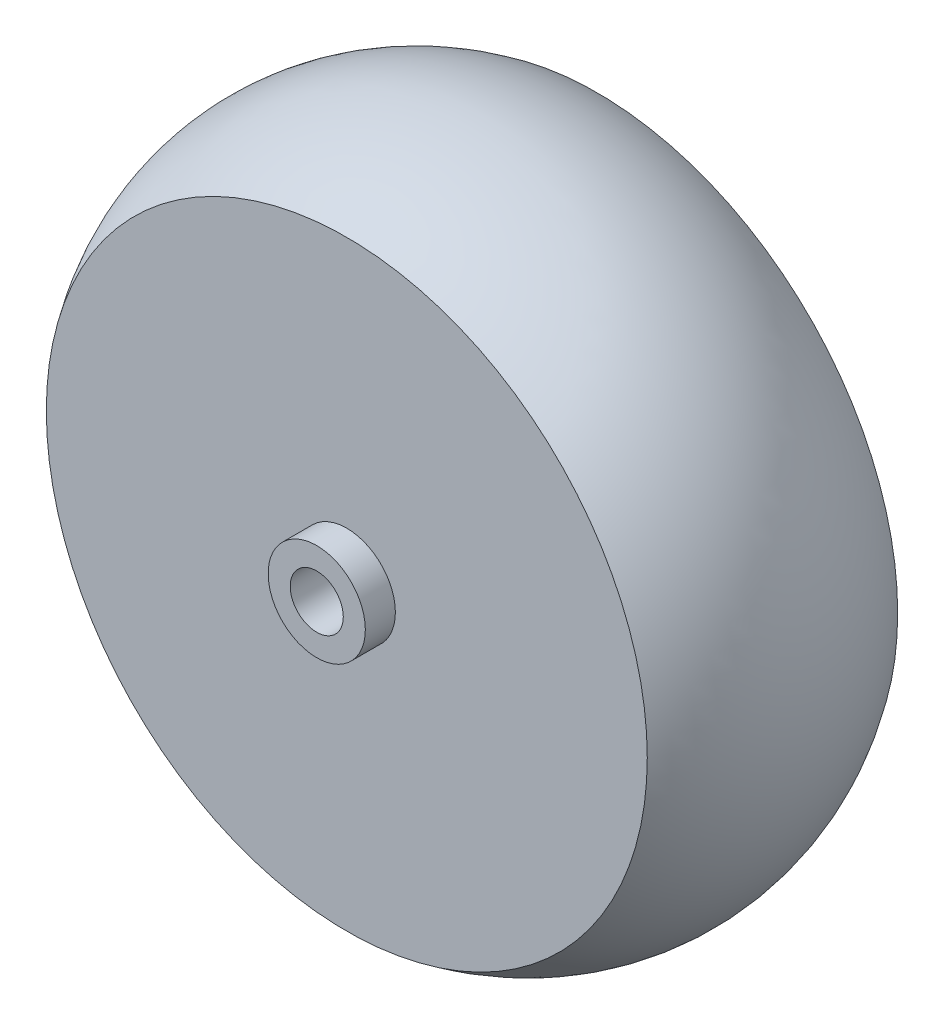
ISO-10303-21;
HEADER;
FILE_DESCRIPTION(('STEP AP214'),'2;1');
FILE_NAME('part.step','',(''),(''),'','','');
FILE_SCHEMA(('AUTOMOTIVE_DESIGN { 1 0 10303 214 1 1 1 1 }'));
ENDSEC;
DATA;
#1=APPLICATION_CONTEXT('core data for automotive mechanical design processes');
#2=APPLICATION_PROTOCOL_DEFINITION('international standard','automotive_design',2000,#1);
#3=PRODUCT_CONTEXT('',#1,'mechanical');
#4=PRODUCT('Part','Part','',(#3));
#5=PRODUCT_RELATED_PRODUCT_CATEGORY('part','',(#4));
#6=PRODUCT_DEFINITION_FORMATION('','',#4);
#7=PRODUCT_DEFINITION_CONTEXT('part definition',#1,'design');
#8=PRODUCT_DEFINITION('design','',#6,#7);
#9=PRODUCT_DEFINITION_SHAPE('','',#8);
#10=(LENGTH_UNIT() NAMED_UNIT(*) SI_UNIT(.MILLI.,.METRE.));
#11=(NAMED_UNIT(*) PLANE_ANGLE_UNIT() SI_UNIT($,.RADIAN.));
#12=(NAMED_UNIT(*) SI_UNIT($,.STERADIAN.) SOLID_ANGLE_UNIT());
#13=UNCERTAINTY_MEASURE_WITH_UNIT(LENGTH_MEASURE(1.E-05),#10,'distance_accuracy_value','');
#14=(GEOMETRIC_REPRESENTATION_CONTEXT(3) GLOBAL_UNCERTAINTY_ASSIGNED_CONTEXT((#13)) GLOBAL_UNIT_ASSIGNED_CONTEXT((#10,
#11,#12)) REPRESENTATION_CONTEXT('',''));
#15=CARTESIAN_POINT('',(0.,0.,0.));
#16=DIRECTION('',(0.,0.,1.));
#17=DIRECTION('',(1.,0.,0.));
#18=AXIS2_PLACEMENT_3D('',#15,#16,#17);
#19=CARTESIAN_POINT('',(1.98997487421324,-1.75,-10.));
#20=DIRECTION('',(0.,-1.,0.));
#21=DIRECTION('',(0.,0.,-1.));
#22=AXIS2_PLACEMENT_3D('',#19,#20,#21);
#23=PLANE('',#22);
#24=DIRECTION('',(-1.,0.,0.));
#25=VECTOR('',#24,1.);
#26=CARTESIAN_POINT('',(1.98997487421324,-1.75,-5.));
#27=LINE('',#26,#25);
#28=CARTESIAN_POINT('',(1.98997487421324,-1.75,-5.));
#29=VERTEX_POINT('',#28);
#30=CARTESIAN_POINT('',(-1.98997487421324,-1.75,-5.));
#31=VERTEX_POINT('',#30);
#32=EDGE_CURVE('E86',#29,#31,#27,.T.);
#33=ORIENTED_EDGE('',*,*,#32,.F.);
#34=DIRECTION('',(0.,0.,1.));
#35=VECTOR('',#34,1.);
#36=CARTESIAN_POINT('',(1.98997487421324,-1.75,-10.));
#37=LINE('',#36,#35);
#38=CARTESIAN_POINT('',(1.98997487421324,-1.75,-10.));
#39=VERTEX_POINT('',#38);
#40=EDGE_CURVE('E105',#39,#29,#37,.T.);
#41=ORIENTED_EDGE('',*,*,#40,.F.);
#42=DIRECTION('',(1.,0.,0.));
#43=VECTOR('',#42,1.);
#44=CARTESIAN_POINT('',(1.98997487421324,-1.75,-10.));
#45=LINE('',#44,#43);
#46=CARTESIAN_POINT('',(-1.98997487421324,-1.75,-10.));
#47=VERTEX_POINT('',#46);
#48=EDGE_CURVE('E92',#47,#39,#45,.T.);
#49=ORIENTED_EDGE('',*,*,#48,.F.);
#50=DIRECTION('',(0.,0.,1.));
#51=VECTOR('',#50,1.);
#52=CARTESIAN_POINT('',(-1.98997487421324,-1.75,-10.));
#53=LINE('',#52,#51);
#54=EDGE_CURVE('E94',#47,#31,#53,.T.);
#55=ORIENTED_EDGE('',*,*,#54,.T.);
#56=EDGE_LOOP('',(#33,#41,#49,#55));
#57=FACE_BOUND('',#56,.T.);
#58=ADVANCED_FACE('F38',(#57),#23,.F.);
#59=CARTESIAN_POINT('',(1.98997487421324,1.75,-10.));
#60=DIRECTION('',(0.,1.,0.));
#61=DIRECTION('',(0.,0.,1.));
#62=AXIS2_PLACEMENT_3D('',#59,#60,#61);
#63=PLANE('',#62);
#64=DIRECTION('',(1.,0.,0.));
#65=VECTOR('',#64,1.);
#66=CARTESIAN_POINT('',(1.98997487421324,1.75,-5.));
#67=LINE('',#66,#65);
#68=CARTESIAN_POINT('',(-1.98997487421324,1.75,-5.));
#69=VERTEX_POINT('',#68);
#70=CARTESIAN_POINT('',(1.98997487421324,1.75,-5.));
#71=VERTEX_POINT('',#70);
#72=EDGE_CURVE('E11',#69,#71,#67,.T.);
#73=ORIENTED_EDGE('',*,*,#72,.F.);
#74=DIRECTION('',(0.,0.,1.));
#75=VECTOR('',#74,1.);
#76=CARTESIAN_POINT('',(-1.98997487421324,1.75,-10.));
#77=LINE('',#76,#75);
#78=CARTESIAN_POINT('',(-1.98997487421324,1.75,-10.));
#79=VERTEX_POINT('',#78);
#80=EDGE_CURVE('E85',#79,#69,#77,.T.);
#81=ORIENTED_EDGE('',*,*,#80,.F.);
#82=DIRECTION('',(-1.,0.,0.));
#83=VECTOR('',#82,1.);
#84=CARTESIAN_POINT('',(1.98997487421324,1.75,-10.));
#85=LINE('',#84,#83);
#86=CARTESIAN_POINT('',(1.98997487421324,1.75,-10.));
#87=VERTEX_POINT('',#86);
#88=EDGE_CURVE('E90',#87,#79,#85,.T.);
#89=ORIENTED_EDGE('',*,*,#88,.F.);
#90=DIRECTION('',(0.,0.,1.));
#91=VECTOR('',#90,1.);
#92=CARTESIAN_POINT('',(1.98997487421324,1.75,-10.));
#93=LINE('',#92,#91);
#94=EDGE_CURVE('E82',#87,#71,#93,.T.);
#95=ORIENTED_EDGE('',*,*,#94,.T.);
#96=EDGE_LOOP('',(#73,#81,#89,#95));
#97=FACE_BOUND('',#96,.T.);
#98=ADVANCED_FACE('F88',(#97),#63,.F.);
#99=CARTESIAN_POINT('',(0.,0.,0.));
#100=DIRECTION('',(0.,0.,1.));
#101=DIRECTION('',(1.,0.,0.));
#102=AXIS2_PLACEMENT_3D('',#99,#100,#101);
#103=PLANE('',#102);
#104=CARTESIAN_POINT('',(0.,0.,0.));
#105=DIRECTION('',(0.,0.,1.));
#106=DIRECTION('',(1.,0.,0.));
#107=AXIS2_PLACEMENT_3D('',#104,#105,#106);
#108=CIRCLE('',#107,2.65);
#109=CARTESIAN_POINT('',(2.65,0.,0.));
#110=VERTEX_POINT('',#109);
#111=EDGE_CURVE('E226',#110,#110,#108,.T.);
#112=ORIENTED_EDGE('',*,*,#111,.F.);
#113=EDGE_LOOP('',(#112));
#114=FACE_BOUND('',#113,.T.);
#115=CARTESIAN_POINT('',(0.,0.,0.));
#116=DIRECTION('',(0.,0.,1.));
#117=DIRECTION('',(1.,0.,0.));
#118=AXIS2_PLACEMENT_3D('',#115,#116,#117);
#119=CIRCLE('',#118,4.85);
#120=CARTESIAN_POINT('',(4.85,0.,0.));
#121=VERTEX_POINT('',#120);
#122=EDGE_CURVE('E46',#121,#121,#119,.T.);
#123=ORIENTED_EDGE('',*,*,#122,.T.);
#124=EDGE_LOOP('',(#123));
#125=FACE_BOUND('',#124,.T.);
#126=ADVANCED_FACE('F40',(#114,#125),#103,.T.);
#127=CARTESIAN_POINT('',(0.,0.,0.));
#128=DIRECTION('',(0.,0.,1.));
#129=DIRECTION('',(1.,0.,0.));
#130=AXIS2_PLACEMENT_3D('',#127,#128,#129);
#131=CYLINDRICAL_SURFACE('',#130,4.85);
#132=CARTESIAN_POINT('',(0.,0.,-3.));
#133=DIRECTION('',(0.,0.,1.));
#134=DIRECTION('',(1.,0.,0.));
#135=AXIS2_PLACEMENT_3D('',#132,#133,#134);
#136=CIRCLE('',#135,4.85);
#137=CARTESIAN_POINT('',(4.85,0.,-3.));
#138=VERTEX_POINT('',#137);
#139=EDGE_CURVE('E108',#138,#138,#136,.T.);
#140=ORIENTED_EDGE('',*,*,#139,.T.);
#141=EDGE_LOOP('',(#140));
#142=FACE_BOUND('',#141,.T.);
#143=ORIENTED_EDGE('',*,*,#122,.F.);
#144=EDGE_LOOP('',(#143));
#145=FACE_BOUND('',#144,.T.);
#146=ADVANCED_FACE('F114',(#142,#145),#131,.T.);
#147=CARTESIAN_POINT('',(4.85,0.,-3.));
#148=DIRECTION('',(0.,0.,1.));
#149=DIRECTION('',(1.,0.,0.));
#150=AXIS2_PLACEMENT_3D('',#147,#148,#149);
#151=PLANE('',#150);
#152=CARTESIAN_POINT('',(0.,0.,-3.00000000000001));
#153=DIRECTION('',(0.,0.,1.));
#154=DIRECTION('',(1.,0.,0.));
#155=AXIS2_PLACEMENT_3D('',#152,#153,#154);
#156=CIRCLE('',#155,30.);
#157=CARTESIAN_POINT('',(30.,0.,-3.00000000000001));
#158=VERTEX_POINT('',#157);
#159=EDGE_CURVE('E104',#158,#158,#156,.T.);
#160=ORIENTED_EDGE('',*,*,#159,.T.);
#161=EDGE_LOOP('',(#160));
#162=FACE_BOUND('',#161,.T.);
#163=ORIENTED_EDGE('',*,*,#139,.F.);
#164=EDGE_LOOP('',(#163));
#165=FACE_BOUND('',#164,.T.);
#166=ADVANCED_FACE('F116',(#162,#165),#151,.T.);
#167=CARTESIAN_POINT('',(0.,0.,-15.5));
#168=DIRECTION('',(0.,0.,1.));
#169=DIRECTION('',(1.,0.,0.));
#170=AXIS2_PLACEMENT_3D('',#167,#168,#169);
#171=DEGENERATE_TOROIDAL_SURFACE('',#170,12.46875,21.53125,.T.);
#172=CARTESIAN_POINT('',(0.,0.,-28.));
#173=DIRECTION('',(0.,0.,1.));
#174=DIRECTION('',(1.,0.,0.));
#175=AXIS2_PLACEMENT_3D('',#172,#173,#174);
#176=CIRCLE('',#175,30.);
#177=CARTESIAN_POINT('',(30.,0.,-28.));
#178=VERTEX_POINT('',#177);
#179=EDGE_CURVE('E101',#178,#178,#176,.T.);
#180=ORIENTED_EDGE('',*,*,#179,.T.);
#181=EDGE_LOOP('',(#180));
#182=FACE_BOUND('',#181,.T.);
#183=ORIENTED_EDGE('',*,*,#159,.F.);
#184=EDGE_LOOP('',(#183));
#185=FACE_BOUND('',#184,.T.);
#186=ADVANCED_FACE('F122',(#182,#185),#171,.T.);
#187=CARTESIAN_POINT('',(0.,0.,-28.));
#188=DIRECTION('',(0.,0.,-1.));
#189=DIRECTION('',(-1.,0.,0.));
#190=AXIS2_PLACEMENT_3D('',#187,#188,#189);
#191=PLANE('',#190);
#192=ORIENTED_EDGE('',*,*,#179,.F.);
#193=EDGE_LOOP('',(#192));
#194=FACE_BOUND('',#193,.T.);
#195=ADVANCED_FACE('F139',(#194),#191,.T.);
#196=CARTESIAN_POINT('',(0.,0.,-10.));
#197=DIRECTION('',(0.,0.,1.));
#198=DIRECTION('',(1.,0.,0.));
#199=AXIS2_PLACEMENT_3D('',#196,#197,#198);
#200=CYLINDRICAL_SURFACE('',#199,2.65);
#201=ORIENTED_EDGE('',*,*,#111,.T.);
#202=EDGE_LOOP('',(#201));
#203=FACE_BOUND('',#202,.T.);
#204=CARTESIAN_POINT('',(0.,0.,-5.));
#205=DIRECTION('',(0.,0.,1.));
#206=DIRECTION('',(1.,0.,0.));
#207=AXIS2_PLACEMENT_3D('',#204,#205,#206);
#208=CIRCLE('',#207,2.65);
#209=EDGE_CURVE('E58',#71,#69,#208,.T.);
#210=ORIENTED_EDGE('',*,*,#209,.F.);
#211=ORIENTED_EDGE('',*,*,#94,.F.);
#212=CARTESIAN_POINT('',(0.,0.,-10.));
#213=DIRECTION('',(0.,0.,1.));
#214=DIRECTION('',(1.,0.,0.));
#215=AXIS2_PLACEMENT_3D('',#212,#213,#214);
#216=CIRCLE('',#215,2.65);
#217=EDGE_CURVE('E233',#39,#87,#216,.T.);
#218=ORIENTED_EDGE('',*,*,#217,.F.);
#219=ORIENTED_EDGE('',*,*,#40,.T.);
#220=EDGE_CURVE('E52',#31,#29,#208,.T.);
#221=ORIENTED_EDGE('',*,*,#220,.F.);
#222=ORIENTED_EDGE('',*,*,#54,.F.);
#223=CARTESIAN_POINT('',(0.,0.,-10.));
#224=DIRECTION('',(0.,0.,1.));
#225=DIRECTION('',(1.,0.,0.));
#226=AXIS2_PLACEMENT_3D('',#223,#224,#225);
#227=CIRCLE('',#226,2.65);
#228=EDGE_CURVE('E97',#79,#47,#227,.T.);
#229=ORIENTED_EDGE('',*,*,#228,.F.);
#230=ORIENTED_EDGE('',*,*,#80,.T.);
#231=EDGE_LOOP('',(#210,#211,#218,#219,#221,#222,#229,#230));
#232=FACE_BOUND('',#231,.T.);
#233=ADVANCED_FACE('F80',(#203,#232),#200,.F.);
#234=CARTESIAN_POINT('',(0.,0.,-10.));
#235=DIRECTION('',(0.,0.,1.));
#236=DIRECTION('',(1.,0.,0.));
#237=AXIS2_PLACEMENT_3D('',#234,#235,#236);
#238=PLANE('',#237);
#239=ORIENTED_EDGE('',*,*,#217,.T.);
#240=ORIENTED_EDGE('',*,*,#88,.T.);
#241=ORIENTED_EDGE('',*,*,#228,.T.);
#242=ORIENTED_EDGE('',*,*,#48,.T.);
#243=EDGE_LOOP('',(#239,#240,#241,#242));
#244=FACE_BOUND('',#243,.T.);
#245=ADVANCED_FACE('F134',(#244),#238,.T.);
#246=CARTESIAN_POINT('',(0.,0.,-5.));
#247=DIRECTION('',(0.,0.,1.));
#248=DIRECTION('',(1.,0.,0.));
#249=AXIS2_PLACEMENT_3D('',#246,#247,#248);
#250=PLANE('',#249);
#251=ORIENTED_EDGE('',*,*,#72,.T.);
#252=ORIENTED_EDGE('',*,*,#209,.T.);
#253=EDGE_LOOP('',(#251,#252));
#254=FACE_BOUND('',#253,.T.);
#255=ADVANCED_FACE('F75',(#254),#250,.T.);
#256=ORIENTED_EDGE('',*,*,#32,.T.);
#257=ORIENTED_EDGE('',*,*,#220,.T.);
#258=EDGE_LOOP('',(#256,#257));
#259=FACE_BOUND('',#258,.T.);
#260=ADVANCED_FACE('F176',(#259),#250,.T.);
#261=CLOSED_SHELL('',(#58,#98,#126,#146,#166,#186,#195,#233,#245,#255,#260));
#262=MANIFOLD_SOLID_BREP('B2',#261);
#263=ADVANCED_BREP_SHAPE_REPRESENTATION('',(#18,#262),#14);
#264=SHAPE_DEFINITION_REPRESENTATION(#9,#263);
ENDSEC;
END-ISO-10303-21;
